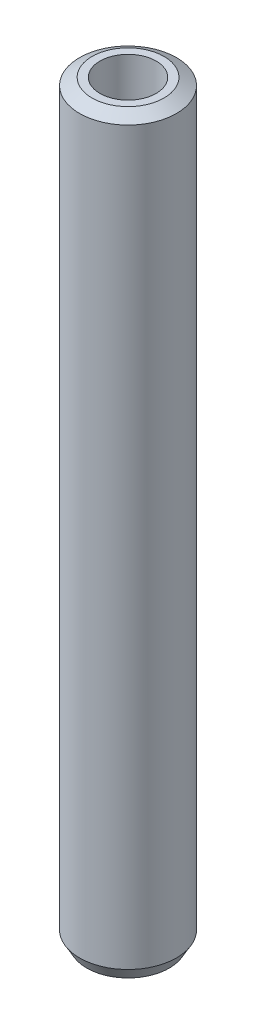
ISO-10303-21;
HEADER;
FILE_DESCRIPTION(('STEP AP214'),'2;1');
FILE_NAME('part.step','',(''),(''),'','','');
FILE_SCHEMA(('AUTOMOTIVE_DESIGN { 1 0 10303 214 1 1 1 1 }'));
ENDSEC;
DATA;
#1=APPLICATION_CONTEXT('core data for automotive mechanical design processes');
#2=APPLICATION_PROTOCOL_DEFINITION('international standard','automotive_design',2000,#1);
#3=PRODUCT_CONTEXT('',#1,'mechanical');
#4=PRODUCT('Part','Part','',(#3));
#5=PRODUCT_RELATED_PRODUCT_CATEGORY('part','',(#4));
#6=PRODUCT_DEFINITION_FORMATION('','',#4);
#7=PRODUCT_DEFINITION_CONTEXT('part definition',#1,'design');
#8=PRODUCT_DEFINITION('design','',#6,#7);
#9=PRODUCT_DEFINITION_SHAPE('','',#8);
#10=(LENGTH_UNIT() NAMED_UNIT(*) SI_UNIT(.MILLI.,.METRE.));
#11=(NAMED_UNIT(*) PLANE_ANGLE_UNIT() SI_UNIT($,.RADIAN.));
#12=(NAMED_UNIT(*) SI_UNIT($,.STERADIAN.) SOLID_ANGLE_UNIT());
#13=UNCERTAINTY_MEASURE_WITH_UNIT(LENGTH_MEASURE(1.E-05),#10,'distance_accuracy_value','');
#14=(GEOMETRIC_REPRESENTATION_CONTEXT(3) GLOBAL_UNCERTAINTY_ASSIGNED_CONTEXT((#13)) GLOBAL_UNIT_ASSIGNED_CONTEXT((#10,
#11,#12)) REPRESENTATION_CONTEXT('',''));
#15=CARTESIAN_POINT('',(0.,0.,0.));
#16=DIRECTION('',(0.,0.,1.));
#17=DIRECTION('',(1.,0.,0.));
#18=AXIS2_PLACEMENT_3D('',#15,#16,#17);
#19=CARTESIAN_POINT('',(0.,581.080085999017,0.));
#20=DIRECTION('',(0.,-1.,0.));
#21=DIRECTION('',(0.,0.,-1.));
#22=AXIS2_PLACEMENT_3D('',#19,#20,#21);
#23=CYLINDRICAL_SURFACE('',#22,37.5);
#24=CARTESIAN_POINT('',(0.,575.52197665506,0.));
#25=DIRECTION('',(0.,1.,0.));
#26=DIRECTION('',(0.,0.,1.));
#27=AXIS2_PLACEMENT_3D('',#24,#25,#26);
#28=CIRCLE('',#27,37.5);
#29=CARTESIAN_POINT('',(0.,575.52197665506,-37.5000000000001));
#30=VERTEX_POINT('',#29);
#31=EDGE_CURVE('E50',#30,#30,#28,.F.);
#32=ORIENTED_EDGE('',*,*,#31,.T.);
#33=EDGE_LOOP('',(#32));
#34=FACE_BOUND('',#33,.T.);
#35=CARTESIAN_POINT('',(0.,9.62692777775476,0.));
#36=DIRECTION('',(0.,1.,0.));
#37=DIRECTION('',(0.,0.,1.));
#38=AXIS2_PLACEMENT_3D('',#35,#36,#37);
#39=CIRCLE('',#38,37.5);
#40=CARTESIAN_POINT('',(0.,9.62692777775476,37.5));
#41=VERTEX_POINT('',#40);
#42=EDGE_CURVE('E51',#41,#41,#39,.T.);
#43=ORIENTED_EDGE('',*,*,#42,.T.);
#44=EDGE_LOOP('',(#43));
#45=FACE_BOUND('',#44,.T.);
#46=ADVANCED_FACE('F39',(#34,#45),#23,.T.);
#47=CARTESIAN_POINT('',(0.,581.080085999017,0.));
#48=DIRECTION('',(0.,1.,0.));
#49=DIRECTION('',(0.,0.,1.));
#50=AXIS2_PLACEMENT_3D('',#47,#48,#49);
#51=PLANE('',#50);
#52=CARTESIAN_POINT('',(0.,581.080085999017,0.));
#53=DIRECTION('',(0.,1.,0.));
#54=DIRECTION('',(0.,0.,1.));
#55=AXIS2_PLACEMENT_3D('',#52,#53,#54);
#56=CIRCLE('',#55,27.873072222245);
#57=CARTESIAN_POINT('',(0.,581.080085999016,-27.8730722222451));
#58=VERTEX_POINT('',#57);
#59=EDGE_CURVE('E54',#58,#58,#56,.T.);
#60=ORIENTED_EDGE('',*,*,#59,.T.);
#61=EDGE_LOOP('',(#60));
#62=FACE_BOUND('',#61,.T.);
#63=CARTESIAN_POINT('',(0.,581.080085999017,0.));
#64=DIRECTION('',(0.,1.,0.));
#65=DIRECTION('',(0.,0.,1.));
#66=AXIS2_PLACEMENT_3D('',#63,#64,#65);
#67=CIRCLE('',#66,21.7386663321981);
#68=CARTESIAN_POINT('',(0.,581.080085999017,21.7386663321981));
#69=VERTEX_POINT('',#68);
#70=EDGE_CURVE('E58',#69,#69,#67,.T.);
#71=ORIENTED_EDGE('',*,*,#70,.F.);
#72=EDGE_LOOP('',(#71));
#73=FACE_BOUND('',#72,.T.);
#74=ADVANCED_FACE('F69',(#62,#73),#51,.T.);
#75=CARTESIAN_POINT('',(0.,0.,0.));
#76=DIRECTION('',(0.,1.,0.));
#77=DIRECTION('',(0.,0.,1.));
#78=AXIS2_PLACEMENT_3D('',#75,#76,#77);
#79=PLANE('',#78);
#80=CARTESIAN_POINT('',(0.,0.,0.));
#81=DIRECTION('',(0.,1.,0.));
#82=DIRECTION('',(0.,0.,1.));
#83=AXIS2_PLACEMENT_3D('',#80,#81,#82);
#84=CIRCLE('',#83,31.9418906560441);
#85=CARTESIAN_POINT('',(0.,0.,31.9418906560441));
#86=VERTEX_POINT('',#85);
#87=EDGE_CURVE('E10',#86,#86,#84,.F.);
#88=ORIENTED_EDGE('',*,*,#87,.T.);
#89=EDGE_LOOP('',(#88));
#90=FACE_BOUND('',#89,.T.);
#91=CARTESIAN_POINT('',(0.,0.,0.));
#92=DIRECTION('',(0.,1.,0.));
#93=DIRECTION('',(0.,0.,1.));
#94=AXIS2_PLACEMENT_3D('',#91,#92,#93);
#95=CIRCLE('',#94,21.7386663321981);
#96=CARTESIAN_POINT('',(0.,0.,21.7386663321981));
#97=VERTEX_POINT('',#96);
#98=EDGE_CURVE('E63',#97,#97,#95,.T.);
#99=ORIENTED_EDGE('',*,*,#98,.T.);
#100=EDGE_LOOP('',(#99));
#101=FACE_BOUND('',#100,.T.);
#102=ADVANCED_FACE('F75',(#90,#101),#79,.F.);
#103=CARTESIAN_POINT('',(0.,581.080085999017,0.));
#104=DIRECTION('',(0.,-1.,0.));
#105=DIRECTION('',(0.,0.,-1.));
#106=AXIS2_PLACEMENT_3D('',#103,#104,#105);
#107=CYLINDRICAL_SURFACE('',#106,21.7386663321981);
#108=ORIENTED_EDGE('',*,*,#70,.T.);
#109=EDGE_LOOP('',(#108));
#110=FACE_BOUND('',#109,.T.);
#111=ORIENTED_EDGE('',*,*,#98,.F.);
#112=EDGE_LOOP('',(#111));
#113=FACE_BOUND('',#112,.T.);
#114=ADVANCED_FACE('F70',(#110,#113),#107,.F.);
#115=CARTESIAN_POINT('',(0.,581.080085999017,0.));
#116=DIRECTION('',(0.,-1.,0.));
#117=DIRECTION('',(0.,0.,-1.));
#118=AXIS2_PLACEMENT_3D('',#115,#116,#117);
#119=CONICAL_SURFACE('',#118,27.873072222245,1.04719755119659);
#120=CARTESIAN_POINT('',(0.,575.52197665506,-37.5000000000001));
#121=CARTESIAN_POINT('',(0.,575.579873627393,-37.3997195023152));
#122=CARTESIAN_POINT('',(0.,575.637770599726,-37.2994390046302));
#123=CARTESIAN_POINT('',(0.,575.753564544392,-37.0988780092603));
#124=CARTESIAN_POINT('',(0.,575.811461516725,-36.9985975115754));
#125=CARTESIAN_POINT('',(0.,575.92725546139,-36.7980365162055));
#126=CARTESIAN_POINT('',(0.,575.985152433723,-36.6977560185205));
#127=CARTESIAN_POINT('',(0.,576.100946378389,-36.4971950231506));
#128=CARTESIAN_POINT('',(0.,576.158843350722,-36.3969145254657));
#129=CARTESIAN_POINT('',(0.,576.274637295388,-36.1963535300958));
#130=CARTESIAN_POINT('',(0.,576.332534267721,-36.0960730324108));
#131=CARTESIAN_POINT('',(0.,576.448328212386,-35.8955120370409));
#132=CARTESIAN_POINT('',(0.,576.506225184719,-35.795231539356));
#133=CARTESIAN_POINT('',(0.,576.622019129385,-35.5946705439861));
#134=CARTESIAN_POINT('',(0.,576.679916101718,-35.4943900463011));
#135=CARTESIAN_POINT('',(0.,576.795710046384,-35.2938290509313));
#136=CARTESIAN_POINT('',(0.,576.853607018717,-35.1935485532463));
#137=CARTESIAN_POINT('',(0.,576.969400963382,-34.9929875578764));
#138=CARTESIAN_POINT('',(0.,577.027297935715,-34.8927070601914));
#139=CARTESIAN_POINT('',(0.,577.143091880381,-34.6921460648216));
#140=CARTESIAN_POINT('',(0.,577.200988852714,-34.5918655671366));
#141=CARTESIAN_POINT('',(0.,577.31678279738,-34.3913045717667));
#142=CARTESIAN_POINT('',(0.,577.374679769712,-34.2910240740818));
#143=CARTESIAN_POINT('',(0.,577.490473714378,-34.0904630787119));
#144=CARTESIAN_POINT('',(0.,577.548370686711,-33.9901825810269));
#145=CARTESIAN_POINT('',(0.,577.664164631377,-33.789621585657));
#146=CARTESIAN_POINT('',(0.,577.72206160371,-33.6893410879721));
#147=CARTESIAN_POINT('',(0.,577.837855548375,-33.4887800926022));
#148=CARTESIAN_POINT('',(0.,577.895752520708,-33.3884995949172));
#149=CARTESIAN_POINT('',(0.,578.011546465374,-33.1879385995473));
#150=CARTESIAN_POINT('',(0.,578.069443437707,-33.0876581018624));
#151=CARTESIAN_POINT('',(0.,578.185237382373,-32.8870971064925));
#152=CARTESIAN_POINT('',(0.,578.243134354705,-32.7868166088076));
#153=CARTESIAN_POINT('',(0.,578.358928299371,-32.5862556134377));
#154=CARTESIAN_POINT('',(0.,578.416825271704,-32.4859751157527));
#155=CARTESIAN_POINT('',(0.,578.53261921637,-32.2854141203828));
#156=CARTESIAN_POINT('',(0.,578.590516188703,-32.1851336226979));
#157=CARTESIAN_POINT('',(0.,578.706310133368,-31.984572627328));
#158=CARTESIAN_POINT('',(0.,578.764207105701,-31.884292129643));
#159=CARTESIAN_POINT('',(0.,578.880001050367,-31.6837311342731));
#160=CARTESIAN_POINT('',(0.,578.9378980227,-31.5834506365882));
#161=CARTESIAN_POINT('',(0.,579.053691967366,-31.3828896412183));
#162=CARTESIAN_POINT('',(0.,579.111588939699,-31.2826091435333));
#163=CARTESIAN_POINT('',(0.,579.227382884364,-31.0820481481634));
#164=CARTESIAN_POINT('',(0.,579.285279856697,-30.9817676504785));
#165=CARTESIAN_POINT('',(0.,579.401073801363,-30.7812066551086));
#166=CARTESIAN_POINT('',(0.,579.458970773696,-30.6809261574236));
#167=CARTESIAN_POINT('',(0.,579.574764718362,-30.4803651620538));
#168=CARTESIAN_POINT('',(0.,579.632661690695,-30.3800846643688));
#169=CARTESIAN_POINT('',(0.,579.74845563536,-30.1795236689989));
#170=CARTESIAN_POINT('',(0.,579.806352607693,-30.0792431713139));
#171=CARTESIAN_POINT('',(0.,579.922146552359,-29.878682175944));
#172=CARTESIAN_POINT('',(0.,579.980043524692,-29.7784016782591));
#173=CARTESIAN_POINT('',(0.,580.095837469358,-29.5778406828892));
#174=CARTESIAN_POINT('',(0.,580.153734441691,-29.4775601852043));
#175=CARTESIAN_POINT('',(0.,580.269528386356,-29.2769991898344));
#176=CARTESIAN_POINT('',(0.,580.327425358689,-29.1767186921494));
#177=CARTESIAN_POINT('',(0.,580.443219303355,-28.9761576967795));
#178=CARTESIAN_POINT('',(0.,580.501116275688,-28.8758771990946));
#179=CARTESIAN_POINT('',(0.,580.616910220353,-28.6753162037247));
#180=CARTESIAN_POINT('',(0.,580.674807192686,-28.5750357060397));
#181=CARTESIAN_POINT('',(0.,580.790601137352,-28.3744747106698));
#182=CARTESIAN_POINT('',(0.,580.848498109685,-28.2741942129849));
#183=CARTESIAN_POINT('',(0.,580.964292054351,-28.073633217615));
#184=CARTESIAN_POINT('',(0.,581.022189026684,-27.97335271993));
#185=CARTESIAN_POINT('',(0.,581.080085999017,-27.8730722222451));
#186=B_SPLINE_CURVE_WITH_KNOTS('',3,(#120,#121,#122,#123,#124,#125,#126,#127,#128,#129,#130,
#131,#132,#133,#134,#135,#136,#137,#138,#139,#140,#141,#142,#143,#144,#145,#146,#147,#148,#149,
#150,#151,#152,#153,#154,#155,#156,#157,#158,#159,#160,#161,#162,#163,#164,#165,#166,#167,#168,
#169,#170,#171,#172,#173,#174,#175,#176,#177,#178,#179,#180,#181,#182,#183,#184,#185),
.UNSPECIFIED.,.F.,.F.,(4,2,2,2,2,2,2,2,2,2,2,2,2,2,2,2,2,2,2,2,2,2,2,2,2,2,2,2,2,2,2,2,4),(0.,
0.34738183399723,0.69476366799446,1.04214550199169,1.38952733598898,1.73690916998621,
2.08429100398344,2.43167283798073,2.77905467197796,3.12643650597519,3.47381833997247,
3.82120017396971,4.16858200796694,4.51596384196422,4.86334567596145,5.21072750995868,
5.55810934395597,5.9054911779532,6.25287301195043,6.60025484594766,6.94763667994495,
7.29501851394218,7.64240034793941,7.98978218193669,8.33716401593392,8.68454584993116,
9.03192768392844,9.37930951792567,9.7266913519229,10.0740731859202,10.4214550199174,
10.7688368539146,11.1162186879119),.UNSPECIFIED.);
#187=EDGE_CURVE('BSEAM81',#30,#58,#186,.T.);
#188=ORIENTED_EDGE('',*,*,#31,.F.);
#189=ORIENTED_EDGE('',*,*,#59,.F.);
#190=ORIENTED_EDGE('',*,*,#187,.T.);
#191=ORIENTED_EDGE('',*,*,#187,.F.);
#192=EDGE_LOOP('',(#188,#190,#189,#191));
#193=FACE_BOUND('',#192,.T.);
#194=ADVANCED_FACE('F81',(#193),#119,.T.);
#195=CARTESIAN_POINT('',(0.,9.62692777775476,0.));
#196=DIRECTION('',(0.,1.,0.));
#197=DIRECTION('',(0.,0.,1.));
#198=AXIS2_PLACEMENT_3D('',#195,#196,#197);
#199=CONICAL_SURFACE('',#198,37.5,0.523598775598309);
#200=ORIENTED_EDGE('',*,*,#87,.F.);
#201=EDGE_LOOP('',(#200));
#202=FACE_BOUND('',#201,.T.);
#203=ORIENTED_EDGE('',*,*,#42,.F.);
#204=EDGE_LOOP('',(#203));
#205=FACE_BOUND('',#204,.T.);
#206=ADVANCED_FACE('F45',(#202,#205),#199,.T.);
#207=CLOSED_SHELL('',(#46,#74,#102,#114,#194,#206));
#208=MANIFOLD_SOLID_BREP('B2',#207);
#209=ADVANCED_BREP_SHAPE_REPRESENTATION('',(#18,#208),#14);
#210=SHAPE_DEFINITION_REPRESENTATION(#9,#209);
ENDSEC;
END-ISO-10303-21;
